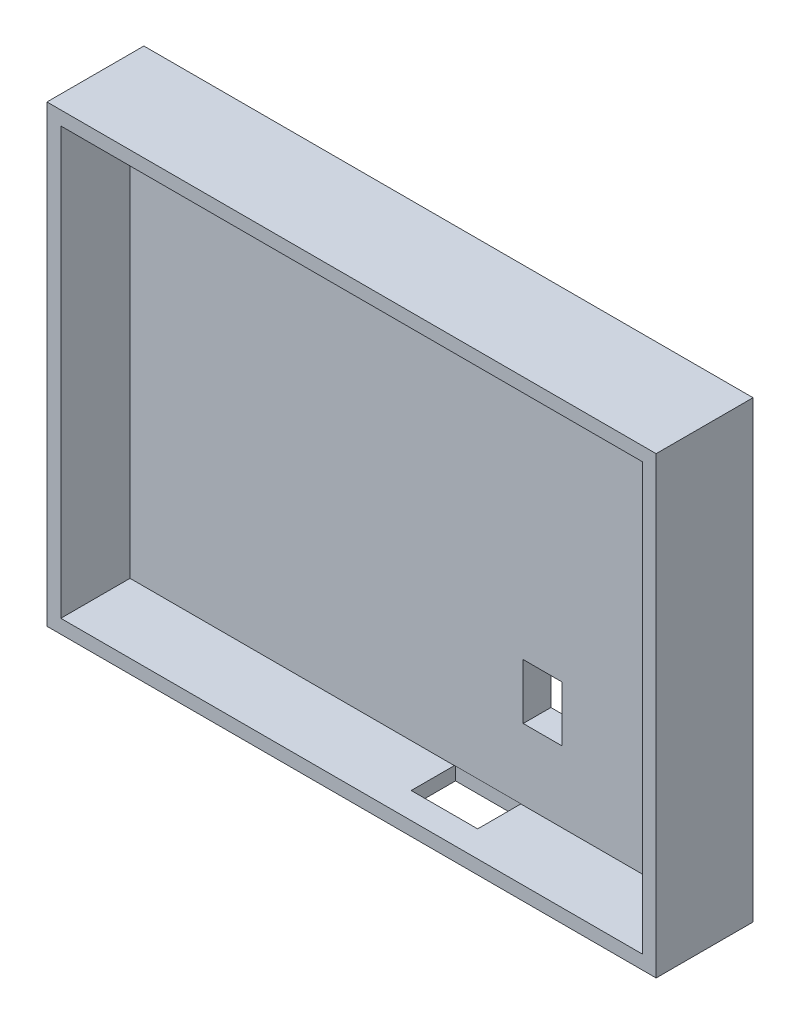
ISO-10303-21;
HEADER;
FILE_DESCRIPTION(('STEP AP214'),'2;1');
FILE_NAME('part.step','',(''),(''),'','','');
FILE_SCHEMA(('AUTOMOTIVE_DESIGN { 1 0 10303 214 1 1 1 1 }'));
ENDSEC;
DATA;
#1=APPLICATION_CONTEXT('core data for automotive mechanical design processes');
#2=APPLICATION_PROTOCOL_DEFINITION('international standard','automotive_design',2000,#1);
#3=PRODUCT_CONTEXT('',#1,'mechanical');
#4=PRODUCT('Part','Part','',(#3));
#5=PRODUCT_RELATED_PRODUCT_CATEGORY('part','',(#4));
#6=PRODUCT_DEFINITION_FORMATION('','',#4);
#7=PRODUCT_DEFINITION_CONTEXT('part definition',#1,'design');
#8=PRODUCT_DEFINITION('design','',#6,#7);
#9=PRODUCT_DEFINITION_SHAPE('','',#8);
#10=(LENGTH_UNIT() NAMED_UNIT(*) SI_UNIT(.MILLI.,.METRE.));
#11=(NAMED_UNIT(*) PLANE_ANGLE_UNIT() SI_UNIT($,.RADIAN.));
#12=(NAMED_UNIT(*) SI_UNIT($,.STERADIAN.) SOLID_ANGLE_UNIT());
#13=UNCERTAINTY_MEASURE_WITH_UNIT(LENGTH_MEASURE(1.E-05),#10,'distance_accuracy_value','');
#14=(GEOMETRIC_REPRESENTATION_CONTEXT(3) GLOBAL_UNCERTAINTY_ASSIGNED_CONTEXT((#13)) GLOBAL_UNIT_ASSIGNED_CONTEXT((#10,
#11,#12)) REPRESENTATION_CONTEXT('',''));
#15=CARTESIAN_POINT('',(0.,0.,0.));
#16=DIRECTION('',(0.,0.,1.));
#17=DIRECTION('',(1.,0.,0.));
#18=AXIS2_PLACEMENT_3D('',#15,#16,#17);
#19=CARTESIAN_POINT('',(0.,0.,5.));
#20=DIRECTION('',(0.,0.,1.));
#21=DIRECTION('',(1.,0.,0.));
#22=AXIS2_PLACEMENT_3D('',#19,#20,#21);
#23=PLANE('',#22);
#24=DIRECTION('',(1.,0.,0.));
#25=VECTOR('',#24,1.);
#26=CARTESIAN_POINT('',(18.5,-15.7,5.));
#27=LINE('',#26,#25);
#28=CARTESIAN_POINT('',(18.5,-15.7,5.));
#29=VERTEX_POINT('',#28);
#30=CARTESIAN_POINT('',(25.5,-15.7,5.));
#31=VERTEX_POINT('',#30);
#32=EDGE_CURVE('E223',#29,#31,#27,.T.);
#33=ORIENTED_EDGE('',*,*,#32,.T.);
#34=DIRECTION('',(0.,-1.,0.));
#35=VECTOR('',#34,1.);
#36=CARTESIAN_POINT('',(25.5,-15.7,5.));
#37=LINE('',#36,#35);
#38=CARTESIAN_POINT('',(25.5,-25.7,5.));
#39=VERTEX_POINT('',#38);
#40=EDGE_CURVE('E211',#31,#39,#37,.T.);
#41=ORIENTED_EDGE('',*,*,#40,.T.);
#42=DIRECTION('',(-1.,0.,0.));
#43=VECTOR('',#42,1.);
#44=CARTESIAN_POINT('',(25.5,-25.7,5.));
#45=LINE('',#44,#43);
#46=CARTESIAN_POINT('',(18.5,-25.7,5.));
#47=VERTEX_POINT('',#46);
#48=EDGE_CURVE('E215',#39,#47,#45,.T.);
#49=ORIENTED_EDGE('',*,*,#48,.T.);
#50=DIRECTION('',(0.,1.,0.));
#51=VECTOR('',#50,1.);
#52=CARTESIAN_POINT('',(18.5,-25.7,5.));
#53=LINE('',#52,#51);
#54=EDGE_CURVE('E219',#47,#29,#53,.T.);
#55=ORIENTED_EDGE('',*,*,#54,.T.);
#56=EDGE_LOOP('',(#33,#41,#49,#55));
#57=FACE_BOUND('',#56,.T.);
#58=DIRECTION('',(-1.,0.,0.));
#59=VECTOR('',#58,1.);
#60=CARTESIAN_POINT('',(0.,-38.46,5.));
#61=LINE('',#60,#59);
#62=CARTESIAN_POINT('',(18.0658773695604,-38.46,5.));
#63=VERTEX_POINT('',#62);
#64=CARTESIAN_POINT('',(6.06587736956045,-38.46,5.));
#65=VERTEX_POINT('',#64);
#66=EDGE_CURVE('E11',#63,#65,#61,.T.);
#67=ORIENTED_EDGE('',*,*,#66,.F.);
#68=DIRECTION('',(0.,-1.,0.));
#69=VECTOR('',#68,1.);
#70=CARTESIAN_POINT('',(18.0658773695604,0.,5.));
#71=LINE('',#70,#69);
#72=CARTESIAN_POINT('',(18.0658773695604,-38.5,5.));
#73=VERTEX_POINT('',#72);
#74=EDGE_CURVE('E171',#63,#73,#71,.T.);
#75=ORIENTED_EDGE('',*,*,#74,.T.);
#76=DIRECTION('',(-1.,0.,0.));
#77=VECTOR('',#76,1.);
#78=CARTESIAN_POINT('',(55.,-38.5,5.));
#79=LINE('',#78,#77);
#80=CARTESIAN_POINT('',(52.5,-38.5,5.));
#81=VERTEX_POINT('',#80);
#82=EDGE_CURVE('E259',#81,#73,#79,.T.);
#83=ORIENTED_EDGE('',*,*,#82,.F.);
#84=DIRECTION('',(0.,-1.,0.));
#85=VECTOR('',#84,1.);
#86=CARTESIAN_POINT('',(52.5,-38.5,5.));
#87=LINE('',#86,#85);
#88=CARTESIAN_POINT('',(52.5,38.5,5.));
#89=VERTEX_POINT('',#88);
#90=EDGE_CURVE('E240',#89,#81,#87,.T.);
#91=ORIENTED_EDGE('',*,*,#90,.F.);
#92=DIRECTION('',(1.,0.,0.));
#93=VECTOR('',#92,1.);
#94=CARTESIAN_POINT('',(55.,38.5,5.));
#95=LINE('',#94,#93);
#96=CARTESIAN_POINT('',(-52.5,38.5,5.));
#97=VERTEX_POINT('',#96);
#98=EDGE_CURVE('E280',#97,#89,#95,.T.);
#99=ORIENTED_EDGE('',*,*,#98,.F.);
#100=DIRECTION('',(0.,1.,0.));
#101=VECTOR('',#100,1.);
#102=CARTESIAN_POINT('',(-52.5,-41.,5.));
#103=LINE('',#102,#101);
#104=CARTESIAN_POINT('',(-52.5,-38.5,5.));
#105=VERTEX_POINT('',#104);
#106=EDGE_CURVE('E266',#105,#97,#103,.T.);
#107=ORIENTED_EDGE('',*,*,#106,.F.);
#108=CARTESIAN_POINT('',(6.06587736956045,-38.5,5.));
#109=VERTEX_POINT('',#108);
#110=EDGE_CURVE('E254',#109,#105,#79,.T.);
#111=ORIENTED_EDGE('',*,*,#110,.F.);
#112=DIRECTION('',(0.,1.,0.));
#113=VECTOR('',#112,1.);
#114=CARTESIAN_POINT('',(6.06587736956045,0.,5.));
#115=LINE('',#114,#113);
#116=EDGE_CURVE('E202',#109,#65,#115,.T.);
#117=ORIENTED_EDGE('',*,*,#116,.T.);
#118=EDGE_LOOP('',(#67,#75,#83,#91,#99,#107,#111,#117));
#119=FACE_BOUND('',#118,.T.);
#120=ADVANCED_FACE('F40',(#57,#119),#23,.T.);
#121=CARTESIAN_POINT('',(55.,-38.5,17.5));
#122=DIRECTION('',(0.,-1.,0.));
#123=DIRECTION('',(1.,0.,0.));
#124=AXIS2_PLACEMENT_3D('',#121,#122,#123);
#125=PLANE('',#124);
#126=DIRECTION('',(0.,0.,-1.));
#127=VECTOR('',#126,1.);
#128=CARTESIAN_POINT('',(18.0658773695604,-38.5,17.5));
#129=LINE('',#128,#127);
#130=CARTESIAN_POINT('',(18.0658773695604,-38.5,12.7924370310883));
#131=VERTEX_POINT('',#130);
#132=EDGE_CURVE('E206',#131,#73,#129,.T.);
#133=ORIENTED_EDGE('',*,*,#132,.F.);
#134=DIRECTION('',(1.,0.,0.));
#135=VECTOR('',#134,1.);
#136=CARTESIAN_POINT('',(55.,-38.5,12.7924370310883));
#137=LINE('',#136,#135);
#138=CARTESIAN_POINT('',(6.06587736956045,-38.5,12.7924370310883));
#139=VERTEX_POINT('',#138);
#140=EDGE_CURVE('E190',#139,#131,#137,.T.);
#141=ORIENTED_EDGE('',*,*,#140,.F.);
#142=DIRECTION('',(0.,0.,1.));
#143=VECTOR('',#142,1.);
#144=CARTESIAN_POINT('',(6.06587736956045,-38.5,17.5));
#145=LINE('',#144,#143);
#146=EDGE_CURVE('E195',#109,#139,#145,.T.);
#147=ORIENTED_EDGE('',*,*,#146,.F.);
#148=ORIENTED_EDGE('',*,*,#110,.T.);
#149=DIRECTION('',(0.,0.,-1.));
#150=VECTOR('',#149,1.);
#151=CARTESIAN_POINT('',(-52.5,-38.5,17.5));
#152=LINE('',#151,#150);
#153=CARTESIAN_POINT('',(-52.5,-38.5,17.5));
#154=VERTEX_POINT('',#153);
#155=EDGE_CURVE('E258',#154,#105,#152,.T.);
#156=ORIENTED_EDGE('',*,*,#155,.F.);
#157=DIRECTION('',(-1.,0.,0.));
#158=VECTOR('',#157,1.);
#159=CARTESIAN_POINT('',(55.,-38.5,17.5));
#160=LINE('',#159,#158);
#161=CARTESIAN_POINT('',(52.5,-38.5,17.5));
#162=VERTEX_POINT('',#161);
#163=EDGE_CURVE('E255',#162,#154,#160,.T.);
#164=ORIENTED_EDGE('',*,*,#163,.F.);
#165=DIRECTION('',(0.,0.,-1.));
#166=VECTOR('',#165,1.);
#167=CARTESIAN_POINT('',(52.5,-38.5,17.5));
#168=LINE('',#167,#166);
#169=EDGE_CURVE('E245',#162,#81,#168,.T.);
#170=ORIENTED_EDGE('',*,*,#169,.T.);
#171=ORIENTED_EDGE('',*,*,#82,.T.);
#172=EDGE_LOOP('',(#133,#141,#147,#148,#156,#164,#170,#171));
#173=FACE_BOUND('',#172,.T.);
#174=ADVANCED_FACE('F373',(#173),#125,.F.);
#175=CARTESIAN_POINT('',(-55.,-41.,5.));
#176=DIRECTION('',(0.,1.,0.));
#177=DIRECTION('',(0.,0.,1.));
#178=AXIS2_PLACEMENT_3D('',#175,#176,#177);
#179=PLANE('',#178);
#180=DIRECTION('',(0.,0.,-1.));
#181=VECTOR('',#180,1.);
#182=CARTESIAN_POINT('',(55.,-41.,5.));
#183=LINE('',#182,#181);
#184=CARTESIAN_POINT('',(55.,-41.,17.5));
#185=VERTEX_POINT('',#184);
#186=CARTESIAN_POINT('',(55.,-41.,0.));
#187=VERTEX_POINT('',#186);
#188=EDGE_CURVE('E322',#185,#187,#183,.T.);
#189=ORIENTED_EDGE('',*,*,#188,.F.);
#190=DIRECTION('',(1.,0.,0.));
#191=VECTOR('',#190,1.);
#192=CARTESIAN_POINT('',(-55.,-41.,17.5));
#193=LINE('',#192,#191);
#194=CARTESIAN_POINT('',(-55.,-41.,17.5));
#195=VERTEX_POINT('',#194);
#196=EDGE_CURVE('E270',#195,#185,#193,.T.);
#197=ORIENTED_EDGE('',*,*,#196,.F.);
#198=DIRECTION('',(0.,0.,-1.));
#199=VECTOR('',#198,1.);
#200=CARTESIAN_POINT('',(-55.,-41.,5.));
#201=LINE('',#200,#199);
#202=CARTESIAN_POINT('',(-55.,-41.,0.));
#203=VERTEX_POINT('',#202);
#204=EDGE_CURVE('E325',#195,#203,#201,.T.);
#205=ORIENTED_EDGE('',*,*,#204,.T.);
#206=DIRECTION('',(1.,0.,0.));
#207=VECTOR('',#206,1.);
#208=CARTESIAN_POINT('',(-55.,-41.,0.));
#209=LINE('',#208,#207);
#210=EDGE_CURVE('E304',#203,#187,#209,.T.);
#211=ORIENTED_EDGE('',*,*,#210,.T.);
#212=EDGE_LOOP('',(#189,#197,#205,#211));
#213=FACE_BOUND('',#212,.T.);
#214=DIRECTION('',(0.,0.,-1.));
#215=VECTOR('',#214,1.);
#216=CARTESIAN_POINT('',(18.0658773695604,-41.,12.7924370310883));
#217=LINE('',#216,#215);
#218=CARTESIAN_POINT('',(18.0658773695605,-41.,12.7924370310883));
#219=VERTEX_POINT('',#218);
#220=CARTESIAN_POINT('',(18.0658773695604,-41.,4.79243703108833));
#221=VERTEX_POINT('',#220);
#222=EDGE_CURVE('E64',#219,#221,#217,.T.);
#223=ORIENTED_EDGE('',*,*,#222,.T.);
#224=DIRECTION('',(-1.,0.,0.));
#225=VECTOR('',#224,1.);
#226=CARTESIAN_POINT('',(18.0658773695604,-41.,4.79243703108833));
#227=LINE('',#226,#225);
#228=CARTESIAN_POINT('',(6.06587736956045,-41.,4.79243703108833));
#229=VERTEX_POINT('',#228);
#230=EDGE_CURVE('E188',#221,#229,#227,.T.);
#231=ORIENTED_EDGE('',*,*,#230,.T.);
#232=DIRECTION('',(0.,0.,1.));
#233=VECTOR('',#232,1.);
#234=CARTESIAN_POINT('',(6.06587736956045,-41.,4.79243703108833));
#235=LINE('',#234,#233);
#236=CARTESIAN_POINT('',(6.06587736956045,-41.,12.7924370310883));
#237=VERTEX_POINT('',#236);
#238=EDGE_CURVE('E409',#229,#237,#235,.T.);
#239=ORIENTED_EDGE('',*,*,#238,.T.);
#240=DIRECTION('',(1.,0.,0.));
#241=VECTOR('',#240,1.);
#242=CARTESIAN_POINT('',(6.06587736956045,-41.,12.7924370310883));
#243=LINE('',#242,#241);
#244=EDGE_CURVE('E176',#237,#219,#243,.T.);
#245=ORIENTED_EDGE('',*,*,#244,.T.);
#246=EDGE_LOOP('',(#223,#231,#239,#245));
#247=FACE_BOUND('',#246,.T.);
#248=ADVANCED_FACE('F378',(#213,#247),#179,.F.);
#249=CARTESIAN_POINT('',(0.,0.,0.));
#250=DIRECTION('',(0.,0.,1.));
#251=DIRECTION('',(1.,0.,0.));
#252=AXIS2_PLACEMENT_3D('',#249,#250,#251);
#253=PLANE('',#252);
#254=DIRECTION('',(0.,-1.,0.));
#255=VECTOR('',#254,1.);
#256=CARTESIAN_POINT('',(-55.,41.,0.));
#257=LINE('',#256,#255);
#258=CARTESIAN_POINT('',(-55.,41.,0.));
#259=VERTEX_POINT('',#258);
#260=EDGE_CURVE('E297',#259,#203,#257,.T.);
#261=ORIENTED_EDGE('',*,*,#260,.F.);
#262=DIRECTION('',(1.,0.,0.));
#263=VECTOR('',#262,1.);
#264=CARTESIAN_POINT('',(-55.,41.,0.));
#265=LINE('',#264,#263);
#266=CARTESIAN_POINT('',(55.,41.,0.));
#267=VERTEX_POINT('',#266);
#268=EDGE_CURVE('E312',#259,#267,#265,.T.);
#269=ORIENTED_EDGE('',*,*,#268,.T.);
#270=DIRECTION('',(0.,-1.,0.));
#271=VECTOR('',#270,1.);
#272=CARTESIAN_POINT('',(55.,41.,0.));
#273=LINE('',#272,#271);
#274=EDGE_CURVE('E308',#267,#187,#273,.T.);
#275=ORIENTED_EDGE('',*,*,#274,.T.);
#276=ORIENTED_EDGE('',*,*,#210,.F.);
#277=EDGE_LOOP('',(#261,#269,#275,#276));
#278=FACE_BOUND('',#277,.T.);
#279=DIRECTION('',(0.,-1.,0.));
#280=VECTOR('',#279,1.);
#281=CARTESIAN_POINT('',(25.5,0.,0.));
#282=LINE('',#281,#280);
#283=CARTESIAN_POINT('',(25.5,-15.7,0.));
#284=VERTEX_POINT('',#283);
#285=CARTESIAN_POINT('',(25.5,-25.7,0.));
#286=VERTEX_POINT('',#285);
#287=EDGE_CURVE('E49',#284,#286,#282,.T.);
#288=ORIENTED_EDGE('',*,*,#287,.F.);
#289=DIRECTION('',(1.,0.,0.));
#290=VECTOR('',#289,1.);
#291=CARTESIAN_POINT('',(0.,-15.7,0.));
#292=LINE('',#291,#290);
#293=CARTESIAN_POINT('',(18.5,-15.7,0.));
#294=VERTEX_POINT('',#293);
#295=EDGE_CURVE('E329',#294,#284,#292,.T.);
#296=ORIENTED_EDGE('',*,*,#295,.F.);
#297=DIRECTION('',(0.,1.,0.));
#298=VECTOR('',#297,1.);
#299=CARTESIAN_POINT('',(18.5,0.,0.));
#300=LINE('',#299,#298);
#301=CARTESIAN_POINT('',(18.5,-25.7,0.));
#302=VERTEX_POINT('',#301);
#303=EDGE_CURVE('E332',#302,#294,#300,.T.);
#304=ORIENTED_EDGE('',*,*,#303,.F.);
#305=DIRECTION('',(-1.,0.,0.));
#306=VECTOR('',#305,1.);
#307=CARTESIAN_POINT('',(0.,-25.7,0.));
#308=LINE('',#307,#306);
#309=EDGE_CURVE('E336',#286,#302,#308,.T.);
#310=ORIENTED_EDGE('',*,*,#309,.F.);
#311=EDGE_LOOP('',(#288,#296,#304,#310));
#312=FACE_BOUND('',#311,.T.);
#313=ADVANCED_FACE('F352',(#278,#312),#253,.F.);
#314=CARTESIAN_POINT('',(55.,38.5,17.5));
#315=DIRECTION('',(0.,1.,0.));
#316=DIRECTION('',(-1.,0.,0.));
#317=AXIS2_PLACEMENT_3D('',#314,#315,#316);
#318=PLANE('',#317);
#319=DIRECTION('',(0.,0.,-1.));
#320=VECTOR('',#319,1.);
#321=CARTESIAN_POINT('',(52.5,38.5,17.5));
#322=LINE('',#321,#320);
#323=CARTESIAN_POINT('',(52.5,38.5,17.5));
#324=VERTEX_POINT('',#323);
#325=EDGE_CURVE('E251',#324,#89,#322,.T.);
#326=ORIENTED_EDGE('',*,*,#325,.F.);
#327=DIRECTION('',(1.,0.,0.));
#328=VECTOR('',#327,1.);
#329=CARTESIAN_POINT('',(55.,38.5,17.5));
#330=LINE('',#329,#328);
#331=CARTESIAN_POINT('',(-52.5,38.5,17.5));
#332=VERTEX_POINT('',#331);
#333=EDGE_CURVE('E285',#332,#324,#330,.T.);
#334=ORIENTED_EDGE('',*,*,#333,.F.);
#335=DIRECTION('',(0.,0.,-1.));
#336=VECTOR('',#335,1.);
#337=CARTESIAN_POINT('',(-52.5,38.5,17.5));
#338=LINE('',#337,#336);
#339=EDGE_CURVE('E274',#332,#97,#338,.T.);
#340=ORIENTED_EDGE('',*,*,#339,.T.);
#341=ORIENTED_EDGE('',*,*,#98,.T.);
#342=EDGE_LOOP('',(#326,#334,#340,#341));
#343=FACE_BOUND('',#342,.T.);
#344=ADVANCED_FACE('F383',(#343),#318,.F.);
#345=CARTESIAN_POINT('',(-52.5,-41.,17.5));
#346=DIRECTION('',(-1.,0.,0.));
#347=DIRECTION('',(0.,0.,1.));
#348=AXIS2_PLACEMENT_3D('',#345,#346,#347);
#349=PLANE('',#348);
#350=ORIENTED_EDGE('',*,*,#155,.T.);
#351=ORIENTED_EDGE('',*,*,#106,.T.);
#352=ORIENTED_EDGE('',*,*,#339,.F.);
#353=DIRECTION('',(0.,1.,0.));
#354=VECTOR('',#353,1.);
#355=CARTESIAN_POINT('',(-52.5,-41.,17.5));
#356=LINE('',#355,#354);
#357=EDGE_CURVE('E267',#154,#332,#356,.T.);
#358=ORIENTED_EDGE('',*,*,#357,.F.);
#359=EDGE_LOOP('',(#350,#351,#352,#358));
#360=FACE_BOUND('',#359,.T.);
#361=ADVANCED_FACE('F437',(#360),#349,.F.);
#362=CARTESIAN_POINT('',(-55.,41.,5.));
#363=DIRECTION('',(1.,0.,0.));
#364=DIRECTION('',(0.,1.,0.));
#365=AXIS2_PLACEMENT_3D('',#362,#363,#364);
#366=PLANE('',#365);
#367=ORIENTED_EDGE('',*,*,#204,.F.);
#368=DIRECTION('',(0.,-1.,0.));
#369=VECTOR('',#368,1.);
#370=CARTESIAN_POINT('',(-55.,38.5,17.5));
#371=LINE('',#370,#369);
#372=CARTESIAN_POINT('',(-55.,41.,17.5));
#373=VERTEX_POINT('',#372);
#374=EDGE_CURVE('E281',#373,#195,#371,.T.);
#375=ORIENTED_EDGE('',*,*,#374,.F.);
#376=DIRECTION('',(0.,0.,-1.));
#377=VECTOR('',#376,1.);
#378=CARTESIAN_POINT('',(-55.,41.,5.));
#379=LINE('',#378,#377);
#380=EDGE_CURVE('E316',#373,#259,#379,.T.);
#381=ORIENTED_EDGE('',*,*,#380,.T.);
#382=ORIENTED_EDGE('',*,*,#260,.T.);
#383=EDGE_LOOP('',(#367,#375,#381,#382));
#384=FACE_BOUND('',#383,.T.);
#385=ADVANCED_FACE('F42',(#384),#366,.F.);
#386=CARTESIAN_POINT('',(55.,41.,5.));
#387=DIRECTION('',(1.,0.,0.));
#388=DIRECTION('',(0.,1.,0.));
#389=AXIS2_PLACEMENT_3D('',#386,#387,#388);
#390=PLANE('',#389);
#391=ORIENTED_EDGE('',*,*,#274,.F.);
#392=DIRECTION('',(0.,0.,-1.));
#393=VECTOR('',#392,1.);
#394=CARTESIAN_POINT('',(55.,41.,5.));
#395=LINE('',#394,#393);
#396=CARTESIAN_POINT('',(55.,41.,17.5));
#397=VERTEX_POINT('',#396);
#398=EDGE_CURVE('E319',#397,#267,#395,.T.);
#399=ORIENTED_EDGE('',*,*,#398,.F.);
#400=DIRECTION('',(0.,1.,0.));
#401=VECTOR('',#400,1.);
#402=CARTESIAN_POINT('',(55.,41.,17.5));
#403=LINE('',#402,#401);
#404=EDGE_CURVE('E289',#185,#397,#403,.T.);
#405=ORIENTED_EDGE('',*,*,#404,.F.);
#406=ORIENTED_EDGE('',*,*,#188,.T.);
#407=EDGE_LOOP('',(#391,#399,#405,#406));
#408=FACE_BOUND('',#407,.T.);
#409=ADVANCED_FACE('F392',(#408),#390,.T.);
#410=CARTESIAN_POINT('',(-55.,41.,5.));
#411=DIRECTION('',(0.,1.,0.));
#412=DIRECTION('',(0.,0.,1.));
#413=AXIS2_PLACEMENT_3D('',#410,#411,#412);
#414=PLANE('',#413);
#415=ORIENTED_EDGE('',*,*,#268,.F.);
#416=ORIENTED_EDGE('',*,*,#380,.F.);
#417=DIRECTION('',(-1.,0.,0.));
#418=VECTOR('',#417,1.);
#419=CARTESIAN_POINT('',(-55.,41.,17.5));
#420=LINE('',#419,#418);
#421=EDGE_CURVE('E293',#397,#373,#420,.T.);
#422=ORIENTED_EDGE('',*,*,#421,.F.);
#423=ORIENTED_EDGE('',*,*,#398,.T.);
#424=EDGE_LOOP('',(#415,#416,#422,#423));
#425=FACE_BOUND('',#424,.T.);
#426=ADVANCED_FACE('F388',(#425),#414,.T.);
#427=CARTESIAN_POINT('',(0.,0.,17.5));
#428=DIRECTION('',(0.,0.,-1.));
#429=DIRECTION('',(-1.,0.,0.));
#430=AXIS2_PLACEMENT_3D('',#427,#428,#429);
#431=PLANE('',#430);
#432=ORIENTED_EDGE('',*,*,#333,.T.);
#433=DIRECTION('',(0.,-1.,0.));
#434=VECTOR('',#433,1.);
#435=CARTESIAN_POINT('',(52.5,-38.5,17.5));
#436=LINE('',#435,#434);
#437=EDGE_CURVE('E241',#324,#162,#436,.T.);
#438=ORIENTED_EDGE('',*,*,#437,.T.);
#439=ORIENTED_EDGE('',*,*,#163,.T.);
#440=ORIENTED_EDGE('',*,*,#357,.T.);
#441=EDGE_LOOP('',(#432,#438,#439,#440));
#442=FACE_BOUND('',#441,.T.);
#443=ORIENTED_EDGE('',*,*,#374,.T.);
#444=ORIENTED_EDGE('',*,*,#196,.T.);
#445=ORIENTED_EDGE('',*,*,#404,.T.);
#446=ORIENTED_EDGE('',*,*,#421,.T.);
#447=EDGE_LOOP('',(#443,#444,#445,#446));
#448=FACE_BOUND('',#447,.T.);
#449=ADVANCED_FACE('F391',(#442,#448),#431,.F.);
#450=CARTESIAN_POINT('',(52.5,-38.5,17.5));
#451=DIRECTION('',(1.,0.,0.));
#452=DIRECTION('',(0.,0.,-1.));
#453=AXIS2_PLACEMENT_3D('',#450,#451,#452);
#454=PLANE('',#453);
#455=ORIENTED_EDGE('',*,*,#90,.T.);
#456=ORIENTED_EDGE('',*,*,#169,.F.);
#457=ORIENTED_EDGE('',*,*,#437,.F.);
#458=ORIENTED_EDGE('',*,*,#325,.T.);
#459=EDGE_LOOP('',(#455,#456,#457,#458));
#460=FACE_BOUND('',#459,.T.);
#461=ADVANCED_FACE('F445',(#460),#454,.F.);
#462=CARTESIAN_POINT('',(25.5,-15.7,-7.5));
#463=DIRECTION('',(-1.,0.,0.));
#464=DIRECTION('',(0.,0.,1.));
#465=AXIS2_PLACEMENT_3D('',#462,#463,#464);
#466=PLANE('',#465);
#467=ORIENTED_EDGE('',*,*,#287,.T.);
#468=DIRECTION('',(0.,0.,1.));
#469=VECTOR('',#468,1.);
#470=CARTESIAN_POINT('',(25.5,-25.7,-7.5));
#471=LINE('',#470,#469);
#472=EDGE_CURVE('E237',#286,#39,#471,.T.);
#473=ORIENTED_EDGE('',*,*,#472,.T.);
#474=ORIENTED_EDGE('',*,*,#40,.F.);
#475=DIRECTION('',(0.,0.,1.));
#476=VECTOR('',#475,1.);
#477=CARTESIAN_POINT('',(25.5,-15.7,-7.5));
#478=LINE('',#477,#476);
#479=EDGE_CURVE('E227',#284,#31,#478,.T.);
#480=ORIENTED_EDGE('',*,*,#479,.F.);
#481=EDGE_LOOP('',(#467,#473,#474,#480));
#482=FACE_BOUND('',#481,.T.);
#483=ADVANCED_FACE('F343',(#482),#466,.T.);
#484=CARTESIAN_POINT('',(25.5,-25.7,-7.5));
#485=DIRECTION('',(0.,1.,0.));
#486=DIRECTION('',(0.,0.,1.));
#487=AXIS2_PLACEMENT_3D('',#484,#485,#486);
#488=PLANE('',#487);
#489=ORIENTED_EDGE('',*,*,#309,.T.);
#490=DIRECTION('',(0.,0.,1.));
#491=VECTOR('',#490,1.);
#492=CARTESIAN_POINT('',(18.5,-25.7,-7.5));
#493=LINE('',#492,#491);
#494=EDGE_CURVE('E234',#302,#47,#493,.T.);
#495=ORIENTED_EDGE('',*,*,#494,.T.);
#496=ORIENTED_EDGE('',*,*,#48,.F.);
#497=ORIENTED_EDGE('',*,*,#472,.F.);
#498=EDGE_LOOP('',(#489,#495,#496,#497));
#499=FACE_BOUND('',#498,.T.);
#500=ADVANCED_FACE('F349',(#499),#488,.T.);
#501=CARTESIAN_POINT('',(18.5,-25.7,-7.5));
#502=DIRECTION('',(1.,0.,0.));
#503=DIRECTION('',(0.,0.,-1.));
#504=AXIS2_PLACEMENT_3D('',#501,#502,#503);
#505=PLANE('',#504);
#506=ORIENTED_EDGE('',*,*,#303,.T.);
#507=DIRECTION('',(0.,0.,1.));
#508=VECTOR('',#507,1.);
#509=CARTESIAN_POINT('',(18.5,-15.7,-7.5));
#510=LINE('',#509,#508);
#511=EDGE_CURVE('E231',#294,#29,#510,.T.);
#512=ORIENTED_EDGE('',*,*,#511,.T.);
#513=ORIENTED_EDGE('',*,*,#54,.F.);
#514=ORIENTED_EDGE('',*,*,#494,.F.);
#515=EDGE_LOOP('',(#506,#512,#513,#514));
#516=FACE_BOUND('',#515,.T.);
#517=ADVANCED_FACE('F354',(#516),#505,.T.);
#518=CARTESIAN_POINT('',(18.5,-15.7,-7.5));
#519=DIRECTION('',(0.,-1.,0.));
#520=DIRECTION('',(0.,0.,-1.));
#521=AXIS2_PLACEMENT_3D('',#518,#519,#520);
#522=PLANE('',#521);
#523=ORIENTED_EDGE('',*,*,#295,.T.);
#524=ORIENTED_EDGE('',*,*,#479,.T.);
#525=ORIENTED_EDGE('',*,*,#32,.F.);
#526=ORIENTED_EDGE('',*,*,#511,.F.);
#527=EDGE_LOOP('',(#523,#524,#525,#526));
#528=FACE_BOUND('',#527,.T.);
#529=ADVANCED_FACE('F360',(#528),#522,.T.);
#530=CARTESIAN_POINT('',(6.06587736956045,-38.46,12.7924370310883));
#531=DIRECTION('',(0.,0.,-1.));
#532=DIRECTION('',(-1.,0.,0.));
#533=AXIS2_PLACEMENT_3D('',#530,#531,#532);
#534=PLANE('',#533);
#535=ORIENTED_EDGE('',*,*,#140,.T.);
#536=DIRECTION('',(0.,-1.,0.));
#537=VECTOR('',#536,1.);
#538=CARTESIAN_POINT('',(18.0658773695604,-38.46,12.7924370310883));
#539=LINE('',#538,#537);
#540=EDGE_CURVE('E417',#131,#219,#539,.T.);
#541=ORIENTED_EDGE('',*,*,#540,.T.);
#542=ORIENTED_EDGE('',*,*,#244,.F.);
#543=DIRECTION('',(0.,-1.,0.));
#544=VECTOR('',#543,1.);
#545=CARTESIAN_POINT('',(6.06587736956045,-38.46,12.7924370310883));
#546=LINE('',#545,#544);
#547=EDGE_CURVE('E56',#139,#237,#546,.T.);
#548=ORIENTED_EDGE('',*,*,#547,.F.);
#549=EDGE_LOOP('',(#535,#541,#542,#548));
#550=FACE_BOUND('',#549,.T.);
#551=ADVANCED_FACE('F362',(#550),#534,.T.);
#552=CARTESIAN_POINT('',(18.0658773695604,-38.46,12.7924370310883));
#553=DIRECTION('',(-1.,0.,0.));
#554=DIRECTION('',(0.,0.,1.));
#555=AXIS2_PLACEMENT_3D('',#552,#553,#554);
#556=PLANE('',#555);
#557=DIRECTION('',(0.,0.,-1.));
#558=VECTOR('',#557,1.);
#559=CARTESIAN_POINT('',(18.0658773695604,-38.46,12.7924370310883));
#560=LINE('',#559,#558);
#561=CARTESIAN_POINT('',(18.0658773695604,-38.46,4.79243703108833));
#562=VERTEX_POINT('',#561);
#563=EDGE_CURVE('E165',#63,#562,#560,.T.);
#564=ORIENTED_EDGE('',*,*,#563,.T.);
#565=DIRECTION('',(0.,-1.,0.));
#566=VECTOR('',#565,1.);
#567=CARTESIAN_POINT('',(18.0658773695604,-38.46,4.79243703108833));
#568=LINE('',#567,#566);
#569=EDGE_CURVE('E169',#562,#221,#568,.T.);
#570=ORIENTED_EDGE('',*,*,#569,.T.);
#571=ORIENTED_EDGE('',*,*,#222,.F.);
#572=ORIENTED_EDGE('',*,*,#540,.F.);
#573=ORIENTED_EDGE('',*,*,#132,.T.);
#574=ORIENTED_EDGE('',*,*,#74,.F.);
#575=EDGE_LOOP('',(#564,#570,#571,#572,#573,#574));
#576=FACE_BOUND('',#575,.T.);
#577=ADVANCED_FACE('F167',(#576),#556,.T.);
#578=CARTESIAN_POINT('',(18.0658773695604,-38.46,4.79243703108833));
#579=DIRECTION('',(0.,0.,1.));
#580=DIRECTION('',(1.,0.,0.));
#581=AXIS2_PLACEMENT_3D('',#578,#579,#580);
#582=PLANE('',#581);
#583=ORIENTED_EDGE('',*,*,#230,.F.);
#584=ORIENTED_EDGE('',*,*,#569,.F.);
#585=DIRECTION('',(-1.,0.,0.));
#586=VECTOR('',#585,1.);
#587=CARTESIAN_POINT('',(18.0658773695604,-38.46,4.79243703108833));
#588=LINE('',#587,#586);
#589=CARTESIAN_POINT('',(6.06587736956045,-38.46,4.79243703108833));
#590=VERTEX_POINT('',#589);
#591=EDGE_CURVE('E175',#562,#590,#588,.T.);
#592=ORIENTED_EDGE('',*,*,#591,.T.);
#593=DIRECTION('',(0.,-1.,0.));
#594=VECTOR('',#593,1.);
#595=CARTESIAN_POINT('',(6.06587736956045,-38.46,4.79243703108833));
#596=LINE('',#595,#594);
#597=EDGE_CURVE('E191',#590,#229,#596,.T.);
#598=ORIENTED_EDGE('',*,*,#597,.T.);
#599=EDGE_LOOP('',(#583,#584,#592,#598));
#600=FACE_BOUND('',#599,.T.);
#601=ADVANCED_FACE('F186',(#600),#582,.T.);
#602=CARTESIAN_POINT('',(6.06587736956045,-38.46,4.79243703108833));
#603=DIRECTION('',(1.,0.,0.));
#604=DIRECTION('',(0.,0.,-1.));
#605=AXIS2_PLACEMENT_3D('',#602,#603,#604);
#606=PLANE('',#605);
#607=ORIENTED_EDGE('',*,*,#146,.T.);
#608=ORIENTED_EDGE('',*,*,#547,.T.);
#609=ORIENTED_EDGE('',*,*,#238,.F.);
#610=ORIENTED_EDGE('',*,*,#597,.F.);
#611=DIRECTION('',(0.,0.,1.));
#612=VECTOR('',#611,1.);
#613=CARTESIAN_POINT('',(6.06587736956045,-38.46,4.79243703108833));
#614=LINE('',#613,#612);
#615=EDGE_CURVE('E181',#590,#65,#614,.T.);
#616=ORIENTED_EDGE('',*,*,#615,.T.);
#617=ORIENTED_EDGE('',*,*,#116,.F.);
#618=EDGE_LOOP('',(#607,#608,#609,#610,#616,#617));
#619=FACE_BOUND('',#618,.T.);
#620=ADVANCED_FACE('F422',(#619),#606,.T.);
#621=CARTESIAN_POINT('',(0.,-38.46,0.));
#622=DIRECTION('',(0.,1.,0.));
#623=DIRECTION('',(0.,0.,1.));
#624=AXIS2_PLACEMENT_3D('',#621,#622,#623);
#625=PLANE('',#624);
#626=ORIENTED_EDGE('',*,*,#66,.T.);
#627=ORIENTED_EDGE('',*,*,#615,.F.);
#628=ORIENTED_EDGE('',*,*,#591,.F.);
#629=ORIENTED_EDGE('',*,*,#563,.F.);
#630=EDGE_LOOP('',(#626,#627,#628,#629));
#631=FACE_BOUND('',#630,.T.);
#632=ADVANCED_FACE('F179',(#631),#625,.F.);
#633=CLOSED_SHELL('',(#120,#174,#248,#313,#344,#361,#385,#409,#426,#449,#461,#483,#500,#517,
#529,#551,#577,#601,#620,#632));
#634=MANIFOLD_SOLID_BREP('B2',#633);
#635=ADVANCED_BREP_SHAPE_REPRESENTATION('',(#18,#634),#14);
#636=SHAPE_DEFINITION_REPRESENTATION(#9,#635);
ENDSEC;
END-ISO-10303-21;
